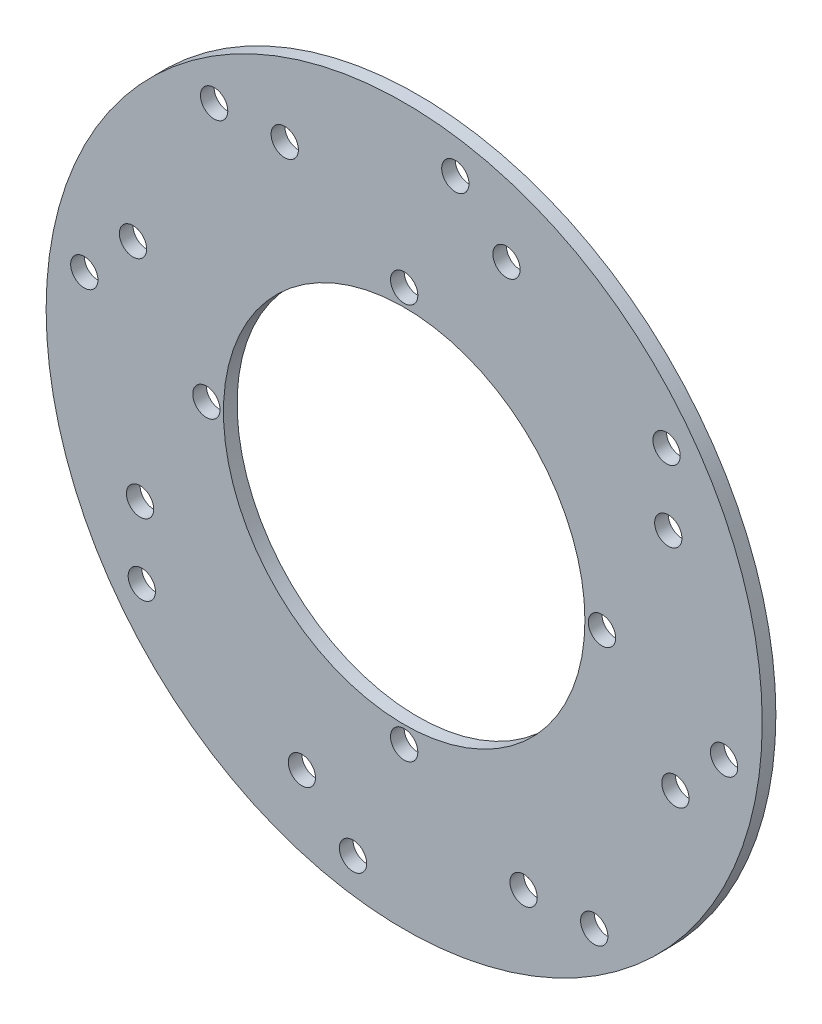
ISO-10303-21;
HEADER;
FILE_DESCRIPTION(('STEP AP214'),'2;1');
FILE_NAME('part.step','',(''),(''),'','','');
FILE_SCHEMA(('AUTOMOTIVE_DESIGN { 1 0 10303 214 1 1 1 1 }'));
ENDSEC;
DATA;
#1=APPLICATION_CONTEXT('core data for automotive mechanical design processes');
#2=APPLICATION_PROTOCOL_DEFINITION('international standard','automotive_design',2000,#1);
#3=PRODUCT_CONTEXT('',#1,'mechanical');
#4=PRODUCT('Part','Part','',(#3));
#5=PRODUCT_RELATED_PRODUCT_CATEGORY('part','',(#4));
#6=PRODUCT_DEFINITION_FORMATION('','',#4);
#7=PRODUCT_DEFINITION_CONTEXT('part definition',#1,'design');
#8=PRODUCT_DEFINITION('design','',#6,#7);
#9=PRODUCT_DEFINITION_SHAPE('','',#8);
#10=(LENGTH_UNIT() NAMED_UNIT(*) SI_UNIT(.MILLI.,.METRE.));
#11=(NAMED_UNIT(*) PLANE_ANGLE_UNIT() SI_UNIT($,.RADIAN.));
#12=(NAMED_UNIT(*) SI_UNIT($,.STERADIAN.) SOLID_ANGLE_UNIT());
#13=UNCERTAINTY_MEASURE_WITH_UNIT(LENGTH_MEASURE(1.E-05),#10,'distance_accuracy_value','');
#14=(GEOMETRIC_REPRESENTATION_CONTEXT(3) GLOBAL_UNCERTAINTY_ASSIGNED_CONTEXT((#13)) GLOBAL_UNIT_ASSIGNED_CONTEXT((#10,
#11,#12)) REPRESENTATION_CONTEXT('',''));
#15=CARTESIAN_POINT('',(0.,0.,0.));
#16=DIRECTION('',(0.,0.,1.));
#17=DIRECTION('',(1.,0.,0.));
#18=AXIS2_PLACEMENT_3D('',#15,#16,#17);
#19=CARTESIAN_POINT('',(0.,0.,4.));
#20=DIRECTION('',(0.,0.,1.));
#21=DIRECTION('',(1.,0.,0.));
#22=AXIS2_PLACEMENT_3D('',#19,#20,#21);
#23=PLANE('',#22);
#24=CARTESIAN_POINT('',(-93.8083151964686,15.,4.));
#25=DIRECTION('',(0.,0.,1.));
#26=DIRECTION('',(1.,0.,0.));
#27=AXIS2_PLACEMENT_3D('',#24,#25,#26);
#28=CIRCLE('',#27,4.00000000000001);
#29=CARTESIAN_POINT('',(-89.8083151964686,15.,4.));
#30=VERTEX_POINT('',#29);
#31=EDGE_CURVE('E155',#30,#30,#28,.T.);
#32=ORIENTED_EDGE('',*,*,#31,.F.);
#33=EDGE_LOOP('',(#32));
#34=FACE_BOUND('',#33,.T.);
#35=CARTESIAN_POINT('',(-15.,-93.8083151964686,4.));
#36=DIRECTION('',(0.,0.,1.));
#37=DIRECTION('',(1.,0.,0.));
#38=AXIS2_PLACEMENT_3D('',#35,#36,#37);
#39=CIRCLE('',#38,4.);
#40=CARTESIAN_POINT('',(-11.,-93.8083151964686,4.));
#41=VERTEX_POINT('',#40);
#42=EDGE_CURVE('E143',#41,#41,#39,.T.);
#43=ORIENTED_EDGE('',*,*,#42,.F.);
#44=EDGE_LOOP('',(#43));
#45=FACE_BOUND('',#44,.T.);
#46=CARTESIAN_POINT('',(93.8083151964686,-15.,4.));
#47=DIRECTION('',(0.,0.,1.));
#48=DIRECTION('',(1.,0.,0.));
#49=AXIS2_PLACEMENT_3D('',#46,#47,#48);
#50=CIRCLE('',#49,4.00000000000001);
#51=CARTESIAN_POINT('',(97.8083151964686,-15.,4.));
#52=VERTEX_POINT('',#51);
#53=EDGE_CURVE('E131',#52,#52,#50,.T.);
#54=ORIENTED_EDGE('',*,*,#53,.F.);
#55=EDGE_LOOP('',(#54));
#56=FACE_BOUND('',#55,.T.);
#57=CARTESIAN_POINT('',(-35.0229059604136,77.4493128316064,4.));
#58=DIRECTION('',(0.,0.,1.));
#59=DIRECTION('',(1.,0.,0.));
#60=AXIS2_PLACEMENT_3D('',#57,#58,#59);
#61=CIRCLE('',#60,4.00000000000001);
#62=CARTESIAN_POINT('',(-31.0229059604135,77.4493128316064,4.));
#63=VERTEX_POINT('',#62);
#64=EDGE_CURVE('E119',#63,#63,#61,.T.);
#65=ORIENTED_EDGE('',*,*,#64,.F.);
#66=EDGE_LOOP('',(#65));
#67=FACE_BOUND('',#66,.T.);
#68=CARTESIAN_POINT('',(-77.4493128316064,-35.0229059604136,4.));
#69=DIRECTION('',(0.,0.,1.));
#70=DIRECTION('',(1.,0.,0.));
#71=AXIS2_PLACEMENT_3D('',#68,#69,#70);
#72=CIRCLE('',#71,4.00000000000001);
#73=CARTESIAN_POINT('',(-73.4493128316064,-35.0229059604136,4.));
#74=VERTEX_POINT('',#73);
#75=EDGE_CURVE('E107',#74,#74,#72,.T.);
#76=ORIENTED_EDGE('',*,*,#75,.F.);
#77=EDGE_LOOP('',(#76));
#78=FACE_BOUND('',#77,.T.);
#79=CARTESIAN_POINT('',(35.0229059604135,-77.4493128316064,4.));
#80=DIRECTION('',(0.,0.,1.));
#81=DIRECTION('',(1.,0.,0.));
#82=AXIS2_PLACEMENT_3D('',#79,#80,#81);
#83=CIRCLE('',#82,4.00000000000001);
#84=CARTESIAN_POINT('',(39.0229059604136,-77.4493128316064,4.));
#85=VERTEX_POINT('',#84);
#86=EDGE_CURVE('E95',#85,#85,#83,.T.);
#87=ORIENTED_EDGE('',*,*,#86,.F.);
#88=EDGE_LOOP('',(#87));
#89=FACE_BOUND('',#88,.T.);
#90=CARTESIAN_POINT('',(77.4493128316064,35.0229059604135,4.));
#91=DIRECTION('',(0.,0.,1.));
#92=DIRECTION('',(1.,0.,0.));
#93=AXIS2_PLACEMENT_3D('',#90,#91,#92);
#94=CIRCLE('',#93,4.00000000000001);
#95=CARTESIAN_POINT('',(81.4493128316064,35.0229059604135,4.));
#96=VERTEX_POINT('',#95);
#97=EDGE_CURVE('E83',#96,#96,#94,.T.);
#98=ORIENTED_EDGE('',*,*,#97,.F.);
#99=EDGE_LOOP('',(#98));
#100=FACE_BOUND('',#99,.T.);
#101=CARTESIAN_POINT('',(0.,-58.,4.));
#102=DIRECTION('',(0.,0.,1.));
#103=DIRECTION('',(1.,0.,0.));
#104=AXIS2_PLACEMENT_3D('',#101,#102,#103);
#105=CIRCLE('',#104,4.);
#106=CARTESIAN_POINT('',(3.99999999999999,-58.,4.));
#107=VERTEX_POINT('',#106);
#108=EDGE_CURVE('E71',#107,#107,#105,.T.);
#109=ORIENTED_EDGE('',*,*,#108,.F.);
#110=EDGE_LOOP('',(#109));
#111=FACE_BOUND('',#110,.T.);
#112=CARTESIAN_POINT('',(15.,93.8083151964686,4.));
#113=DIRECTION('',(0.,0.,1.));
#114=DIRECTION('',(1.,0.,0.));
#115=AXIS2_PLACEMENT_3D('',#112,#113,#114);
#116=CIRCLE('',#115,4.);
#117=CARTESIAN_POINT('',(19.,93.8083151964686,4.));
#118=VERTEX_POINT('',#117);
#119=EDGE_CURVE('E59',#118,#118,#116,.T.);
#120=ORIENTED_EDGE('',*,*,#119,.F.);
#121=EDGE_LOOP('',(#120));
#122=FACE_BOUND('',#121,.T.);
#123=CARTESIAN_POINT('',(0.,58.,4.));
#124=DIRECTION('',(0.,0.,1.));
#125=DIRECTION('',(1.,0.,0.));
#126=AXIS2_PLACEMENT_3D('',#123,#124,#125);
#127=CIRCLE('',#126,4.);
#128=CARTESIAN_POINT('',(4.,58.,4.));
#129=VERTEX_POINT('',#128);
#130=EDGE_CURVE('E47',#129,#129,#127,.T.);
#131=ORIENTED_EDGE('',*,*,#130,.F.);
#132=EDGE_LOOP('',(#131));
#133=FACE_BOUND('',#132,.T.);
#134=CARTESIAN_POINT('',(0.,0.,4.));
#135=DIRECTION('',(0.,0.,1.));
#136=DIRECTION('',(1.,0.,0.));
#137=AXIS2_PLACEMENT_3D('',#134,#135,#136);
#138=CIRCLE('',#137,105.);
#139=CARTESIAN_POINT('',(105.,0.,4.));
#140=VERTEX_POINT('',#139);
#141=EDGE_CURVE('E10',#140,#140,#138,.T.);
#142=ORIENTED_EDGE('',*,*,#141,.T.);
#143=EDGE_LOOP('',(#142));
#144=FACE_BOUND('',#143,.T.);
#145=CARTESIAN_POINT('',(0.,0.,4.));
#146=DIRECTION('',(0.,0.,1.));
#147=DIRECTION('',(1.,0.,0.));
#148=AXIS2_PLACEMENT_3D('',#145,#146,#147);
#149=CIRCLE('',#148,53.);
#150=CARTESIAN_POINT('',(53.,0.,4.));
#151=VERTEX_POINT('',#150);
#152=EDGE_CURVE('E42',#151,#151,#149,.T.);
#153=ORIENTED_EDGE('',*,*,#152,.F.);
#154=EDGE_LOOP('',(#153));
#155=FACE_BOUND('',#154,.T.);
#156=CARTESIAN_POINT('',(30.,79.5298686029343,4.));
#157=DIRECTION('',(0.,0.,1.));
#158=DIRECTION('',(1.,0.,0.));
#159=AXIS2_PLACEMENT_3D('',#156,#157,#158);
#160=CIRCLE('',#159,4.);
#161=CARTESIAN_POINT('',(34.,79.5298686029343,4.));
#162=VERTEX_POINT('',#161);
#163=EDGE_CURVE('E53',#162,#162,#160,.T.);
#164=ORIENTED_EDGE('',*,*,#163,.F.);
#165=EDGE_LOOP('',(#164));
#166=FACE_BOUND('',#165,.T.);
#167=CARTESIAN_POINT('',(58.,0.,4.));
#168=DIRECTION('',(0.,0.,1.));
#169=DIRECTION('',(1.,0.,0.));
#170=AXIS2_PLACEMENT_3D('',#167,#168,#169);
#171=CIRCLE('',#170,4.00000000000001);
#172=CARTESIAN_POINT('',(62.,0.,4.));
#173=VERTEX_POINT('',#172);
#174=EDGE_CURVE('E65',#173,#173,#171,.T.);
#175=ORIENTED_EDGE('',*,*,#174,.F.);
#176=EDGE_LOOP('',(#175));
#177=FACE_BOUND('',#176,.T.);
#178=CARTESIAN_POINT('',(-58.,0.,4.));
#179=DIRECTION('',(0.,0.,1.));
#180=DIRECTION('',(1.,0.,0.));
#181=AXIS2_PLACEMENT_3D('',#178,#179,#180);
#182=CIRCLE('',#181,4.00000000000001);
#183=CARTESIAN_POINT('',(-54.,0.,4.));
#184=VERTEX_POINT('',#183);
#185=EDGE_CURVE('E77',#184,#184,#182,.T.);
#186=ORIENTED_EDGE('',*,*,#185,.F.);
#187=EDGE_LOOP('',(#186));
#188=FACE_BOUND('',#187,.T.);
#189=CARTESIAN_POINT('',(79.5298686029343,-30.,4.));
#190=DIRECTION('',(0.,0.,1.));
#191=DIRECTION('',(1.,0.,0.));
#192=AXIS2_PLACEMENT_3D('',#189,#190,#191);
#193=CIRCLE('',#192,4.00000000000001);
#194=CARTESIAN_POINT('',(83.5298686029343,-30.,4.));
#195=VERTEX_POINT('',#194);
#196=EDGE_CURVE('E89',#195,#195,#193,.T.);
#197=ORIENTED_EDGE('',*,*,#196,.F.);
#198=EDGE_LOOP('',(#197));
#199=FACE_BOUND('',#198,.T.);
#200=CARTESIAN_POINT('',(-30.,-79.5298686029343,4.));
#201=DIRECTION('',(0.,0.,1.));
#202=DIRECTION('',(1.,0.,0.));
#203=AXIS2_PLACEMENT_3D('',#200,#201,#202);
#204=CIRCLE('',#203,4.00000000000001);
#205=CARTESIAN_POINT('',(-26.,-79.5298686029343,4.));
#206=VERTEX_POINT('',#205);
#207=EDGE_CURVE('E101',#206,#206,#204,.T.);
#208=ORIENTED_EDGE('',*,*,#207,.F.);
#209=EDGE_LOOP('',(#208));
#210=FACE_BOUND('',#209,.T.);
#211=CARTESIAN_POINT('',(-79.5298686029343,30.,4.));
#212=DIRECTION('',(0.,0.,1.));
#213=DIRECTION('',(1.,0.,0.));
#214=AXIS2_PLACEMENT_3D('',#211,#212,#213);
#215=CIRCLE('',#214,4.00000000000001);
#216=CARTESIAN_POINT('',(-75.5298686029343,30.,4.));
#217=VERTEX_POINT('',#216);
#218=EDGE_CURVE('E113',#217,#217,#215,.T.);
#219=ORIENTED_EDGE('',*,*,#218,.F.);
#220=EDGE_LOOP('',(#219));
#221=FACE_BOUND('',#220,.T.);
#222=CARTESIAN_POINT('',(76.9390975249062,55.7258940893098,4.));
#223=DIRECTION('',(0.,0.,1.));
#224=DIRECTION('',(1.,0.,0.));
#225=AXIS2_PLACEMENT_3D('',#222,#223,#224);
#226=CIRCLE('',#225,4.00000000000001);
#227=CARTESIAN_POINT('',(80.9390975249062,55.7258940893098,4.));
#228=VERTEX_POINT('',#227);
#229=EDGE_CURVE('E125',#228,#228,#226,.T.);
#230=ORIENTED_EDGE('',*,*,#229,.F.);
#231=EDGE_LOOP('',(#230));
#232=FACE_BOUND('',#231,.T.);
#233=CARTESIAN_POINT('',(55.7258940893098,-76.9390975249062,4.));
#234=DIRECTION('',(0.,0.,1.));
#235=DIRECTION('',(1.,0.,0.));
#236=AXIS2_PLACEMENT_3D('',#233,#234,#235);
#237=CIRCLE('',#236,4.00000000000001);
#238=CARTESIAN_POINT('',(59.7258940893098,-76.9390975249062,4.));
#239=VERTEX_POINT('',#238);
#240=EDGE_CURVE('E137',#239,#239,#237,.T.);
#241=ORIENTED_EDGE('',*,*,#240,.F.);
#242=EDGE_LOOP('',(#241));
#243=FACE_BOUND('',#242,.T.);
#244=CARTESIAN_POINT('',(-76.9390975249062,-55.7258940893098,4.));
#245=DIRECTION('',(0.,0.,1.));
#246=DIRECTION('',(1.,0.,0.));
#247=AXIS2_PLACEMENT_3D('',#244,#245,#246);
#248=CIRCLE('',#247,4.00000000000001);
#249=CARTESIAN_POINT('',(-72.9390975249062,-55.7258940893098,4.));
#250=VERTEX_POINT('',#249);
#251=EDGE_CURVE('E149',#250,#250,#248,.T.);
#252=ORIENTED_EDGE('',*,*,#251,.F.);
#253=EDGE_LOOP('',(#252));
#254=FACE_BOUND('',#253,.T.);
#255=CARTESIAN_POINT('',(-55.7258940893098,76.9390975249062,4.));
#256=DIRECTION('',(0.,0.,1.));
#257=DIRECTION('',(1.,0.,0.));
#258=AXIS2_PLACEMENT_3D('',#255,#256,#257);
#259=CIRCLE('',#258,4.00000000000001);
#260=CARTESIAN_POINT('',(-51.7258940893098,76.9390975249062,4.));
#261=VERTEX_POINT('',#260);
#262=EDGE_CURVE('E161',#261,#261,#259,.T.);
#263=ORIENTED_EDGE('',*,*,#262,.F.);
#264=EDGE_LOOP('',(#263));
#265=FACE_BOUND('',#264,.T.);
#266=ADVANCED_FACE('F31',(#34,#45,#56,#67,#78,#89,#100,#111,#122,#133,#144,#155,#166,#177,#188,
#199,#210,#221,#232,#243,#254,#265),#23,.T.);
#267=CARTESIAN_POINT('',(0.,0.,0.));
#268=DIRECTION('',(0.,0.,1.));
#269=DIRECTION('',(1.,0.,0.));
#270=AXIS2_PLACEMENT_3D('',#267,#268,#269);
#271=PLANE('',#270);
#272=CARTESIAN_POINT('',(0.,0.,0.));
#273=DIRECTION('',(0.,0.,1.));
#274=DIRECTION('',(1.,0.,0.));
#275=AXIS2_PLACEMENT_3D('',#272,#273,#274);
#276=CIRCLE('',#275,105.);
#277=CARTESIAN_POINT('',(105.,0.,0.));
#278=VERTEX_POINT('',#277);
#279=EDGE_CURVE('E35',#278,#278,#276,.T.);
#280=ORIENTED_EDGE('',*,*,#279,.F.);
#281=EDGE_LOOP('',(#280));
#282=FACE_BOUND('',#281,.T.);
#283=CARTESIAN_POINT('',(0.,0.,0.));
#284=DIRECTION('',(0.,0.,1.));
#285=DIRECTION('',(1.,0.,0.));
#286=AXIS2_PLACEMENT_3D('',#283,#284,#285);
#287=CIRCLE('',#286,53.);
#288=CARTESIAN_POINT('',(53.,0.,0.));
#289=VERTEX_POINT('',#288);
#290=EDGE_CURVE('E44',#289,#289,#287,.T.);
#291=ORIENTED_EDGE('',*,*,#290,.T.);
#292=EDGE_LOOP('',(#291));
#293=FACE_BOUND('',#292,.T.);
#294=CARTESIAN_POINT('',(0.,58.,0.));
#295=DIRECTION('',(0.,0.,1.));
#296=DIRECTION('',(1.,0.,0.));
#297=AXIS2_PLACEMENT_3D('',#294,#295,#296);
#298=CIRCLE('',#297,4.);
#299=CARTESIAN_POINT('',(4.,58.,0.));
#300=VERTEX_POINT('',#299);
#301=EDGE_CURVE('E50',#300,#300,#298,.T.);
#302=ORIENTED_EDGE('',*,*,#301,.T.);
#303=EDGE_LOOP('',(#302));
#304=FACE_BOUND('',#303,.T.);
#305=CARTESIAN_POINT('',(30.,79.5298686029343,0.));
#306=DIRECTION('',(0.,0.,1.));
#307=DIRECTION('',(1.,0.,0.));
#308=AXIS2_PLACEMENT_3D('',#305,#306,#307);
#309=CIRCLE('',#308,4.);
#310=CARTESIAN_POINT('',(34.,79.5298686029343,0.));
#311=VERTEX_POINT('',#310);
#312=EDGE_CURVE('E56',#311,#311,#309,.T.);
#313=ORIENTED_EDGE('',*,*,#312,.T.);
#314=EDGE_LOOP('',(#313));
#315=FACE_BOUND('',#314,.T.);
#316=CARTESIAN_POINT('',(15.,93.8083151964686,0.));
#317=DIRECTION('',(0.,0.,1.));
#318=DIRECTION('',(1.,0.,0.));
#319=AXIS2_PLACEMENT_3D('',#316,#317,#318);
#320=CIRCLE('',#319,4.);
#321=CARTESIAN_POINT('',(19.,93.8083151964686,0.));
#322=VERTEX_POINT('',#321);
#323=EDGE_CURVE('E62',#322,#322,#320,.T.);
#324=ORIENTED_EDGE('',*,*,#323,.T.);
#325=EDGE_LOOP('',(#324));
#326=FACE_BOUND('',#325,.T.);
#327=CARTESIAN_POINT('',(58.,0.,0.));
#328=DIRECTION('',(0.,0.,1.));
#329=DIRECTION('',(1.,0.,0.));
#330=AXIS2_PLACEMENT_3D('',#327,#328,#329);
#331=CIRCLE('',#330,4.00000000000001);
#332=CARTESIAN_POINT('',(62.,0.,0.));
#333=VERTEX_POINT('',#332);
#334=EDGE_CURVE('E68',#333,#333,#331,.T.);
#335=ORIENTED_EDGE('',*,*,#334,.T.);
#336=EDGE_LOOP('',(#335));
#337=FACE_BOUND('',#336,.T.);
#338=CARTESIAN_POINT('',(0.,-58.,0.));
#339=DIRECTION('',(0.,0.,1.));
#340=DIRECTION('',(1.,0.,0.));
#341=AXIS2_PLACEMENT_3D('',#338,#339,#340);
#342=CIRCLE('',#341,4.);
#343=CARTESIAN_POINT('',(3.99999999999999,-58.,0.));
#344=VERTEX_POINT('',#343);
#345=EDGE_CURVE('E74',#344,#344,#342,.T.);
#346=ORIENTED_EDGE('',*,*,#345,.T.);
#347=EDGE_LOOP('',(#346));
#348=FACE_BOUND('',#347,.T.);
#349=CARTESIAN_POINT('',(-58.,0.,0.));
#350=DIRECTION('',(0.,0.,1.));
#351=DIRECTION('',(1.,0.,0.));
#352=AXIS2_PLACEMENT_3D('',#349,#350,#351);
#353=CIRCLE('',#352,4.00000000000001);
#354=CARTESIAN_POINT('',(-54.,0.,0.));
#355=VERTEX_POINT('',#354);
#356=EDGE_CURVE('E80',#355,#355,#353,.T.);
#357=ORIENTED_EDGE('',*,*,#356,.T.);
#358=EDGE_LOOP('',(#357));
#359=FACE_BOUND('',#358,.T.);
#360=CARTESIAN_POINT('',(77.4493128316064,35.0229059604135,0.));
#361=DIRECTION('',(0.,0.,1.));
#362=DIRECTION('',(1.,0.,0.));
#363=AXIS2_PLACEMENT_3D('',#360,#361,#362);
#364=CIRCLE('',#363,4.00000000000001);
#365=CARTESIAN_POINT('',(81.4493128316064,35.0229059604135,0.));
#366=VERTEX_POINT('',#365);
#367=EDGE_CURVE('E86',#366,#366,#364,.T.);
#368=ORIENTED_EDGE('',*,*,#367,.T.);
#369=EDGE_LOOP('',(#368));
#370=FACE_BOUND('',#369,.T.);
#371=CARTESIAN_POINT('',(79.5298686029343,-30.,0.));
#372=DIRECTION('',(0.,0.,1.));
#373=DIRECTION('',(1.,0.,0.));
#374=AXIS2_PLACEMENT_3D('',#371,#372,#373);
#375=CIRCLE('',#374,4.00000000000001);
#376=CARTESIAN_POINT('',(83.5298686029343,-30.,0.));
#377=VERTEX_POINT('',#376);
#378=EDGE_CURVE('E92',#377,#377,#375,.T.);
#379=ORIENTED_EDGE('',*,*,#378,.T.);
#380=EDGE_LOOP('',(#379));
#381=FACE_BOUND('',#380,.T.);
#382=CARTESIAN_POINT('',(35.0229059604135,-77.4493128316064,0.));
#383=DIRECTION('',(0.,0.,1.));
#384=DIRECTION('',(1.,0.,0.));
#385=AXIS2_PLACEMENT_3D('',#382,#383,#384);
#386=CIRCLE('',#385,4.00000000000001);
#387=CARTESIAN_POINT('',(39.0229059604136,-77.4493128316064,0.));
#388=VERTEX_POINT('',#387);
#389=EDGE_CURVE('E98',#388,#388,#386,.T.);
#390=ORIENTED_EDGE('',*,*,#389,.T.);
#391=EDGE_LOOP('',(#390));
#392=FACE_BOUND('',#391,.T.);
#393=CARTESIAN_POINT('',(-30.,-79.5298686029343,0.));
#394=DIRECTION('',(0.,0.,1.));
#395=DIRECTION('',(1.,0.,0.));
#396=AXIS2_PLACEMENT_3D('',#393,#394,#395);
#397=CIRCLE('',#396,4.00000000000001);
#398=CARTESIAN_POINT('',(-26.,-79.5298686029343,0.));
#399=VERTEX_POINT('',#398);
#400=EDGE_CURVE('E104',#399,#399,#397,.T.);
#401=ORIENTED_EDGE('',*,*,#400,.T.);
#402=EDGE_LOOP('',(#401));
#403=FACE_BOUND('',#402,.T.);
#404=CARTESIAN_POINT('',(-77.4493128316064,-35.0229059604136,0.));
#405=DIRECTION('',(0.,0.,1.));
#406=DIRECTION('',(1.,0.,0.));
#407=AXIS2_PLACEMENT_3D('',#404,#405,#406);
#408=CIRCLE('',#407,4.00000000000001);
#409=CARTESIAN_POINT('',(-73.4493128316064,-35.0229059604136,0.));
#410=VERTEX_POINT('',#409);
#411=EDGE_CURVE('E110',#410,#410,#408,.T.);
#412=ORIENTED_EDGE('',*,*,#411,.T.);
#413=EDGE_LOOP('',(#412));
#414=FACE_BOUND('',#413,.T.);
#415=CARTESIAN_POINT('',(-79.5298686029343,30.,0.));
#416=DIRECTION('',(0.,0.,1.));
#417=DIRECTION('',(1.,0.,0.));
#418=AXIS2_PLACEMENT_3D('',#415,#416,#417);
#419=CIRCLE('',#418,4.00000000000001);
#420=CARTESIAN_POINT('',(-75.5298686029343,30.,0.));
#421=VERTEX_POINT('',#420);
#422=EDGE_CURVE('E116',#421,#421,#419,.T.);
#423=ORIENTED_EDGE('',*,*,#422,.T.);
#424=EDGE_LOOP('',(#423));
#425=FACE_BOUND('',#424,.T.);
#426=CARTESIAN_POINT('',(-35.0229059604136,77.4493128316064,0.));
#427=DIRECTION('',(0.,0.,1.));
#428=DIRECTION('',(1.,0.,0.));
#429=AXIS2_PLACEMENT_3D('',#426,#427,#428);
#430=CIRCLE('',#429,4.00000000000001);
#431=CARTESIAN_POINT('',(-31.0229059604135,77.4493128316064,0.));
#432=VERTEX_POINT('',#431);
#433=EDGE_CURVE('E122',#432,#432,#430,.T.);
#434=ORIENTED_EDGE('',*,*,#433,.T.);
#435=EDGE_LOOP('',(#434));
#436=FACE_BOUND('',#435,.T.);
#437=CARTESIAN_POINT('',(76.9390975249062,55.7258940893098,0.));
#438=DIRECTION('',(0.,0.,1.));
#439=DIRECTION('',(1.,0.,0.));
#440=AXIS2_PLACEMENT_3D('',#437,#438,#439);
#441=CIRCLE('',#440,4.00000000000001);
#442=CARTESIAN_POINT('',(80.9390975249062,55.7258940893098,0.));
#443=VERTEX_POINT('',#442);
#444=EDGE_CURVE('E128',#443,#443,#441,.T.);
#445=ORIENTED_EDGE('',*,*,#444,.T.);
#446=EDGE_LOOP('',(#445));
#447=FACE_BOUND('',#446,.T.);
#448=CARTESIAN_POINT('',(93.8083151964686,-15.,0.));
#449=DIRECTION('',(0.,0.,1.));
#450=DIRECTION('',(1.,0.,0.));
#451=AXIS2_PLACEMENT_3D('',#448,#449,#450);
#452=CIRCLE('',#451,4.00000000000001);
#453=CARTESIAN_POINT('',(97.8083151964686,-15.,0.));
#454=VERTEX_POINT('',#453);
#455=EDGE_CURVE('E134',#454,#454,#452,.T.);
#456=ORIENTED_EDGE('',*,*,#455,.T.);
#457=EDGE_LOOP('',(#456));
#458=FACE_BOUND('',#457,.T.);
#459=CARTESIAN_POINT('',(55.7258940893098,-76.9390975249062,0.));
#460=DIRECTION('',(0.,0.,1.));
#461=DIRECTION('',(1.,0.,0.));
#462=AXIS2_PLACEMENT_3D('',#459,#460,#461);
#463=CIRCLE('',#462,4.00000000000001);
#464=CARTESIAN_POINT('',(59.7258940893098,-76.9390975249062,0.));
#465=VERTEX_POINT('',#464);
#466=EDGE_CURVE('E140',#465,#465,#463,.T.);
#467=ORIENTED_EDGE('',*,*,#466,.T.);
#468=EDGE_LOOP('',(#467));
#469=FACE_BOUND('',#468,.T.);
#470=CARTESIAN_POINT('',(-15.,-93.8083151964686,0.));
#471=DIRECTION('',(0.,0.,1.));
#472=DIRECTION('',(1.,0.,0.));
#473=AXIS2_PLACEMENT_3D('',#470,#471,#472);
#474=CIRCLE('',#473,4.);
#475=CARTESIAN_POINT('',(-11.,-93.8083151964686,0.));
#476=VERTEX_POINT('',#475);
#477=EDGE_CURVE('E146',#476,#476,#474,.T.);
#478=ORIENTED_EDGE('',*,*,#477,.T.);
#479=EDGE_LOOP('',(#478));
#480=FACE_BOUND('',#479,.T.);
#481=CARTESIAN_POINT('',(-76.9390975249062,-55.7258940893098,0.));
#482=DIRECTION('',(0.,0.,1.));
#483=DIRECTION('',(1.,0.,0.));
#484=AXIS2_PLACEMENT_3D('',#481,#482,#483);
#485=CIRCLE('',#484,4.00000000000001);
#486=CARTESIAN_POINT('',(-72.9390975249062,-55.7258940893098,0.));
#487=VERTEX_POINT('',#486);
#488=EDGE_CURVE('E152',#487,#487,#485,.T.);
#489=ORIENTED_EDGE('',*,*,#488,.T.);
#490=EDGE_LOOP('',(#489));
#491=FACE_BOUND('',#490,.T.);
#492=CARTESIAN_POINT('',(-93.8083151964686,15.,0.));
#493=DIRECTION('',(0.,0.,1.));
#494=DIRECTION('',(1.,0.,0.));
#495=AXIS2_PLACEMENT_3D('',#492,#493,#494);
#496=CIRCLE('',#495,4.00000000000001);
#497=CARTESIAN_POINT('',(-89.8083151964686,15.,0.));
#498=VERTEX_POINT('',#497);
#499=EDGE_CURVE('E158',#498,#498,#496,.T.);
#500=ORIENTED_EDGE('',*,*,#499,.T.);
#501=EDGE_LOOP('',(#500));
#502=FACE_BOUND('',#501,.T.);
#503=CARTESIAN_POINT('',(-55.7258940893098,76.9390975249062,0.));
#504=DIRECTION('',(0.,0.,1.));
#505=DIRECTION('',(1.,0.,0.));
#506=AXIS2_PLACEMENT_3D('',#503,#504,#505);
#507=CIRCLE('',#506,4.00000000000001);
#508=CARTESIAN_POINT('',(-51.7258940893098,76.9390975249062,0.));
#509=VERTEX_POINT('',#508);
#510=EDGE_CURVE('E164',#509,#509,#507,.T.);
#511=ORIENTED_EDGE('',*,*,#510,.T.);
#512=EDGE_LOOP('',(#511));
#513=FACE_BOUND('',#512,.T.);
#514=ADVANCED_FACE('F174',(#282,#293,#304,#315,#326,#337,#348,#359,#370,#381,#392,#403,#414,
#425,#436,#447,#458,#469,#480,#491,#502,#513),#271,.F.);
#515=CARTESIAN_POINT('',(0.,0.,4.));
#516=DIRECTION('',(0.,0.,-1.));
#517=DIRECTION('',(-1.,0.,0.));
#518=AXIS2_PLACEMENT_3D('',#515,#516,#517);
#519=CYLINDRICAL_SURFACE('',#518,105.);
#520=ORIENTED_EDGE('',*,*,#141,.F.);
#521=EDGE_LOOP('',(#520));
#522=FACE_BOUND('',#521,.T.);
#523=ORIENTED_EDGE('',*,*,#279,.T.);
#524=EDGE_LOOP('',(#523));
#525=FACE_BOUND('',#524,.T.);
#526=ADVANCED_FACE('F33',(#522,#525),#519,.T.);
#527=CARTESIAN_POINT('',(0.,0.,4.));
#528=DIRECTION('',(0.,0.,-1.));
#529=DIRECTION('',(-1.,0.,0.));
#530=AXIS2_PLACEMENT_3D('',#527,#528,#529);
#531=CYLINDRICAL_SURFACE('',#530,53.);
#532=ORIENTED_EDGE('',*,*,#152,.T.);
#533=EDGE_LOOP('',(#532));
#534=FACE_BOUND('',#533,.T.);
#535=ORIENTED_EDGE('',*,*,#290,.F.);
#536=EDGE_LOOP('',(#535));
#537=FACE_BOUND('',#536,.T.);
#538=ADVANCED_FACE('F184',(#534,#537),#531,.F.);
#539=CARTESIAN_POINT('',(0.,58.,4.));
#540=DIRECTION('',(0.,0.,-1.));
#541=DIRECTION('',(-1.,0.,0.));
#542=AXIS2_PLACEMENT_3D('',#539,#540,#541);
#543=CYLINDRICAL_SURFACE('',#542,4.);
#544=ORIENTED_EDGE('',*,*,#130,.T.);
#545=EDGE_LOOP('',(#544));
#546=FACE_BOUND('',#545,.T.);
#547=ORIENTED_EDGE('',*,*,#301,.F.);
#548=EDGE_LOOP('',(#547));
#549=FACE_BOUND('',#548,.T.);
#550=ADVANCED_FACE('F187',(#546,#549),#543,.F.);
#551=CARTESIAN_POINT('',(30.,79.5298686029343,4.));
#552=DIRECTION('',(0.,0.,-1.));
#553=DIRECTION('',(-1.,0.,0.));
#554=AXIS2_PLACEMENT_3D('',#551,#552,#553);
#555=CYLINDRICAL_SURFACE('',#554,4.);
#556=ORIENTED_EDGE('',*,*,#163,.T.);
#557=EDGE_LOOP('',(#556));
#558=FACE_BOUND('',#557,.T.);
#559=ORIENTED_EDGE('',*,*,#312,.F.);
#560=EDGE_LOOP('',(#559));
#561=FACE_BOUND('',#560,.T.);
#562=ADVANCED_FACE('F191',(#558,#561),#555,.F.);
#563=CARTESIAN_POINT('',(15.,93.8083151964686,4.));
#564=DIRECTION('',(0.,0.,-1.));
#565=DIRECTION('',(-1.,0.,0.));
#566=AXIS2_PLACEMENT_3D('',#563,#564,#565);
#567=CYLINDRICAL_SURFACE('',#566,4.);
#568=ORIENTED_EDGE('',*,*,#119,.T.);
#569=EDGE_LOOP('',(#568));
#570=FACE_BOUND('',#569,.T.);
#571=ORIENTED_EDGE('',*,*,#323,.F.);
#572=EDGE_LOOP('',(#571));
#573=FACE_BOUND('',#572,.T.);
#574=ADVANCED_FACE('F195',(#570,#573),#567,.F.);
#575=CARTESIAN_POINT('',(58.,0.,4.));
#576=DIRECTION('',(0.,0.,-1.));
#577=DIRECTION('',(-1.,0.,0.));
#578=AXIS2_PLACEMENT_3D('',#575,#576,#577);
#579=CYLINDRICAL_SURFACE('',#578,4.00000000000001);
#580=ORIENTED_EDGE('',*,*,#174,.T.);
#581=EDGE_LOOP('',(#580));
#582=FACE_BOUND('',#581,.T.);
#583=ORIENTED_EDGE('',*,*,#334,.F.);
#584=EDGE_LOOP('',(#583));
#585=FACE_BOUND('',#584,.T.);
#586=ADVANCED_FACE('F199',(#582,#585),#579,.F.);
#587=CARTESIAN_POINT('',(0.,-58.,4.));
#588=DIRECTION('',(0.,0.,-1.));
#589=DIRECTION('',(-1.,0.,0.));
#590=AXIS2_PLACEMENT_3D('',#587,#588,#589);
#591=CYLINDRICAL_SURFACE('',#590,4.);
#592=ORIENTED_EDGE('',*,*,#108,.T.);
#593=EDGE_LOOP('',(#592));
#594=FACE_BOUND('',#593,.T.);
#595=ORIENTED_EDGE('',*,*,#345,.F.);
#596=EDGE_LOOP('',(#595));
#597=FACE_BOUND('',#596,.T.);
#598=ADVANCED_FACE('F203',(#594,#597),#591,.F.);
#599=CARTESIAN_POINT('',(-58.,0.,4.));
#600=DIRECTION('',(0.,0.,-1.));
#601=DIRECTION('',(-1.,0.,0.));
#602=AXIS2_PLACEMENT_3D('',#599,#600,#601);
#603=CYLINDRICAL_SURFACE('',#602,4.00000000000001);
#604=ORIENTED_EDGE('',*,*,#185,.T.);
#605=EDGE_LOOP('',(#604));
#606=FACE_BOUND('',#605,.T.);
#607=ORIENTED_EDGE('',*,*,#356,.F.);
#608=EDGE_LOOP('',(#607));
#609=FACE_BOUND('',#608,.T.);
#610=ADVANCED_FACE('F207',(#606,#609),#603,.F.);
#611=CARTESIAN_POINT('',(77.4493128316064,35.0229059604135,4.));
#612=DIRECTION('',(0.,0.,-1.));
#613=DIRECTION('',(-1.,0.,0.));
#614=AXIS2_PLACEMENT_3D('',#611,#612,#613);
#615=CYLINDRICAL_SURFACE('',#614,4.00000000000001);
#616=ORIENTED_EDGE('',*,*,#97,.T.);
#617=EDGE_LOOP('',(#616));
#618=FACE_BOUND('',#617,.T.);
#619=ORIENTED_EDGE('',*,*,#367,.F.);
#620=EDGE_LOOP('',(#619));
#621=FACE_BOUND('',#620,.T.);
#622=ADVANCED_FACE('F211',(#618,#621),#615,.F.);
#623=CARTESIAN_POINT('',(79.5298686029343,-30.,4.));
#624=DIRECTION('',(0.,0.,-1.));
#625=DIRECTION('',(-1.,0.,0.));
#626=AXIS2_PLACEMENT_3D('',#623,#624,#625);
#627=CYLINDRICAL_SURFACE('',#626,4.00000000000001);
#628=ORIENTED_EDGE('',*,*,#196,.T.);
#629=EDGE_LOOP('',(#628));
#630=FACE_BOUND('',#629,.T.);
#631=ORIENTED_EDGE('',*,*,#378,.F.);
#632=EDGE_LOOP('',(#631));
#633=FACE_BOUND('',#632,.T.);
#634=ADVANCED_FACE('F215',(#630,#633),#627,.F.);
#635=CARTESIAN_POINT('',(35.0229059604135,-77.4493128316064,4.));
#636=DIRECTION('',(0.,0.,-1.));
#637=DIRECTION('',(-1.,0.,0.));
#638=AXIS2_PLACEMENT_3D('',#635,#636,#637);
#639=CYLINDRICAL_SURFACE('',#638,4.00000000000001);
#640=ORIENTED_EDGE('',*,*,#86,.T.);
#641=EDGE_LOOP('',(#640));
#642=FACE_BOUND('',#641,.T.);
#643=ORIENTED_EDGE('',*,*,#389,.F.);
#644=EDGE_LOOP('',(#643));
#645=FACE_BOUND('',#644,.T.);
#646=ADVANCED_FACE('F219',(#642,#645),#639,.F.);
#647=CARTESIAN_POINT('',(-30.,-79.5298686029343,4.));
#648=DIRECTION('',(0.,0.,-1.));
#649=DIRECTION('',(-1.,0.,0.));
#650=AXIS2_PLACEMENT_3D('',#647,#648,#649);
#651=CYLINDRICAL_SURFACE('',#650,4.00000000000001);
#652=ORIENTED_EDGE('',*,*,#207,.T.);
#653=EDGE_LOOP('',(#652));
#654=FACE_BOUND('',#653,.T.);
#655=ORIENTED_EDGE('',*,*,#400,.F.);
#656=EDGE_LOOP('',(#655));
#657=FACE_BOUND('',#656,.T.);
#658=ADVANCED_FACE('F223',(#654,#657),#651,.F.);
#659=CARTESIAN_POINT('',(-77.4493128316064,-35.0229059604136,4.));
#660=DIRECTION('',(0.,0.,-1.));
#661=DIRECTION('',(-1.,0.,0.));
#662=AXIS2_PLACEMENT_3D('',#659,#660,#661);
#663=CYLINDRICAL_SURFACE('',#662,4.00000000000001);
#664=ORIENTED_EDGE('',*,*,#75,.T.);
#665=EDGE_LOOP('',(#664));
#666=FACE_BOUND('',#665,.T.);
#667=ORIENTED_EDGE('',*,*,#411,.F.);
#668=EDGE_LOOP('',(#667));
#669=FACE_BOUND('',#668,.T.);
#670=ADVANCED_FACE('F227',(#666,#669),#663,.F.);
#671=CARTESIAN_POINT('',(-79.5298686029343,30.,4.));
#672=DIRECTION('',(0.,0.,-1.));
#673=DIRECTION('',(-1.,0.,0.));
#674=AXIS2_PLACEMENT_3D('',#671,#672,#673);
#675=CYLINDRICAL_SURFACE('',#674,4.00000000000001);
#676=ORIENTED_EDGE('',*,*,#218,.T.);
#677=EDGE_LOOP('',(#676));
#678=FACE_BOUND('',#677,.T.);
#679=ORIENTED_EDGE('',*,*,#422,.F.);
#680=EDGE_LOOP('',(#679));
#681=FACE_BOUND('',#680,.T.);
#682=ADVANCED_FACE('F231',(#678,#681),#675,.F.);
#683=CARTESIAN_POINT('',(-35.0229059604136,77.4493128316064,4.));
#684=DIRECTION('',(0.,0.,-1.));
#685=DIRECTION('',(-1.,0.,0.));
#686=AXIS2_PLACEMENT_3D('',#683,#684,#685);
#687=CYLINDRICAL_SURFACE('',#686,4.00000000000001);
#688=ORIENTED_EDGE('',*,*,#64,.T.);
#689=EDGE_LOOP('',(#688));
#690=FACE_BOUND('',#689,.T.);
#691=ORIENTED_EDGE('',*,*,#433,.F.);
#692=EDGE_LOOP('',(#691));
#693=FACE_BOUND('',#692,.T.);
#694=ADVANCED_FACE('F235',(#690,#693),#687,.F.);
#695=CARTESIAN_POINT('',(76.9390975249062,55.7258940893098,4.));
#696=DIRECTION('',(0.,0.,-1.));
#697=DIRECTION('',(-1.,0.,0.));
#698=AXIS2_PLACEMENT_3D('',#695,#696,#697);
#699=CYLINDRICAL_SURFACE('',#698,4.00000000000001);
#700=ORIENTED_EDGE('',*,*,#229,.T.);
#701=EDGE_LOOP('',(#700));
#702=FACE_BOUND('',#701,.T.);
#703=ORIENTED_EDGE('',*,*,#444,.F.);
#704=EDGE_LOOP('',(#703));
#705=FACE_BOUND('',#704,.T.);
#706=ADVANCED_FACE('F239',(#702,#705),#699,.F.);
#707=CARTESIAN_POINT('',(93.8083151964686,-15.,4.));
#708=DIRECTION('',(0.,0.,-1.));
#709=DIRECTION('',(-1.,0.,0.));
#710=AXIS2_PLACEMENT_3D('',#707,#708,#709);
#711=CYLINDRICAL_SURFACE('',#710,4.00000000000001);
#712=ORIENTED_EDGE('',*,*,#53,.T.);
#713=EDGE_LOOP('',(#712));
#714=FACE_BOUND('',#713,.T.);
#715=ORIENTED_EDGE('',*,*,#455,.F.);
#716=EDGE_LOOP('',(#715));
#717=FACE_BOUND('',#716,.T.);
#718=ADVANCED_FACE('F243',(#714,#717),#711,.F.);
#719=CARTESIAN_POINT('',(55.7258940893098,-76.9390975249062,4.));
#720=DIRECTION('',(0.,0.,-1.));
#721=DIRECTION('',(-1.,0.,0.));
#722=AXIS2_PLACEMENT_3D('',#719,#720,#721);
#723=CYLINDRICAL_SURFACE('',#722,4.00000000000001);
#724=ORIENTED_EDGE('',*,*,#240,.T.);
#725=EDGE_LOOP('',(#724));
#726=FACE_BOUND('',#725,.T.);
#727=ORIENTED_EDGE('',*,*,#466,.F.);
#728=EDGE_LOOP('',(#727));
#729=FACE_BOUND('',#728,.T.);
#730=ADVANCED_FACE('F247',(#726,#729),#723,.F.);
#731=CARTESIAN_POINT('',(-15.,-93.8083151964686,4.));
#732=DIRECTION('',(0.,0.,-1.));
#733=DIRECTION('',(-1.,0.,0.));
#734=AXIS2_PLACEMENT_3D('',#731,#732,#733);
#735=CYLINDRICAL_SURFACE('',#734,4.);
#736=ORIENTED_EDGE('',*,*,#42,.T.);
#737=EDGE_LOOP('',(#736));
#738=FACE_BOUND('',#737,.T.);
#739=ORIENTED_EDGE('',*,*,#477,.F.);
#740=EDGE_LOOP('',(#739));
#741=FACE_BOUND('',#740,.T.);
#742=ADVANCED_FACE('F251',(#738,#741),#735,.F.);
#743=CARTESIAN_POINT('',(-76.9390975249062,-55.7258940893098,4.));
#744=DIRECTION('',(0.,0.,-1.));
#745=DIRECTION('',(-1.,0.,0.));
#746=AXIS2_PLACEMENT_3D('',#743,#744,#745);
#747=CYLINDRICAL_SURFACE('',#746,4.00000000000001);
#748=ORIENTED_EDGE('',*,*,#251,.T.);
#749=EDGE_LOOP('',(#748));
#750=FACE_BOUND('',#749,.T.);
#751=ORIENTED_EDGE('',*,*,#488,.F.);
#752=EDGE_LOOP('',(#751));
#753=FACE_BOUND('',#752,.T.);
#754=ADVANCED_FACE('F255',(#750,#753),#747,.F.);
#755=CARTESIAN_POINT('',(-93.8083151964686,15.,4.));
#756=DIRECTION('',(0.,0.,-1.));
#757=DIRECTION('',(-1.,0.,0.));
#758=AXIS2_PLACEMENT_3D('',#755,#756,#757);
#759=CYLINDRICAL_SURFACE('',#758,4.00000000000001);
#760=ORIENTED_EDGE('',*,*,#31,.T.);
#761=EDGE_LOOP('',(#760));
#762=FACE_BOUND('',#761,.T.);
#763=ORIENTED_EDGE('',*,*,#499,.F.);
#764=EDGE_LOOP('',(#763));
#765=FACE_BOUND('',#764,.T.);
#766=ADVANCED_FACE('F259',(#762,#765),#759,.F.);
#767=CARTESIAN_POINT('',(-55.7258940893098,76.9390975249062,4.));
#768=DIRECTION('',(0.,0.,-1.));
#769=DIRECTION('',(-1.,0.,0.));
#770=AXIS2_PLACEMENT_3D('',#767,#768,#769);
#771=CYLINDRICAL_SURFACE('',#770,4.00000000000001);
#772=ORIENTED_EDGE('',*,*,#262,.T.);
#773=EDGE_LOOP('',(#772));
#774=FACE_BOUND('',#773,.T.);
#775=ORIENTED_EDGE('',*,*,#510,.F.);
#776=EDGE_LOOP('',(#775));
#777=FACE_BOUND('',#776,.T.);
#778=ADVANCED_FACE('F170',(#774,#777),#771,.F.);
#779=CLOSED_SHELL('',(#266,#514,#526,#538,#550,#562,#574,#586,#598,#610,#622,#634,#646,#658,
#670,#682,#694,#706,#718,#730,#742,#754,#766,#778));
#780=MANIFOLD_SOLID_BREP('B2',#779);
#781=ADVANCED_BREP_SHAPE_REPRESENTATION('',(#18,#780),#14);
#782=SHAPE_DEFINITION_REPRESENTATION(#9,#781);
ENDSEC;
END-ISO-10303-21;
